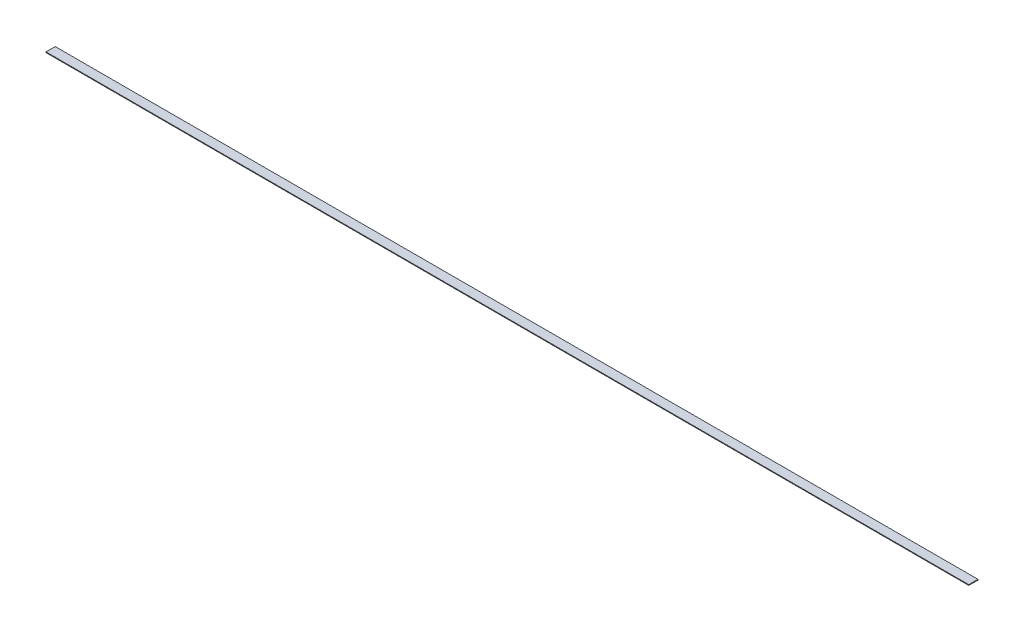
ISO-10303-21;
HEADER;
FILE_DESCRIPTION(('STEP AP214'),'2;1');
FILE_NAME('part.step','',(''),(''),'','','');
FILE_SCHEMA(('AUTOMOTIVE_DESIGN { 1 0 10303 214 1 1 1 1 }'));
ENDSEC;
DATA;
#1=APPLICATION_CONTEXT('core data for automotive mechanical design processes');
#2=APPLICATION_PROTOCOL_DEFINITION('international standard','automotive_design',2000,#1);
#3=PRODUCT_CONTEXT('',#1,'mechanical');
#4=PRODUCT('Part','Part','',(#3));
#5=PRODUCT_RELATED_PRODUCT_CATEGORY('part','',(#4));
#6=PRODUCT_DEFINITION_FORMATION('','',#4);
#7=PRODUCT_DEFINITION_CONTEXT('part definition',#1,'design');
#8=PRODUCT_DEFINITION('design','',#6,#7);
#9=PRODUCT_DEFINITION_SHAPE('','',#8);
#10=(LENGTH_UNIT() NAMED_UNIT(*) SI_UNIT(.MILLI.,.METRE.));
#11=(NAMED_UNIT(*) PLANE_ANGLE_UNIT() SI_UNIT($,.RADIAN.));
#12=(NAMED_UNIT(*) SI_UNIT($,.STERADIAN.) SOLID_ANGLE_UNIT());
#13=UNCERTAINTY_MEASURE_WITH_UNIT(LENGTH_MEASURE(1.E-05),#10,'distance_accuracy_value','');
#14=(GEOMETRIC_REPRESENTATION_CONTEXT(3) GLOBAL_UNCERTAINTY_ASSIGNED_CONTEXT((#13)) GLOBAL_UNIT_ASSIGNED_CONTEXT((#10,
#11,#12)) REPRESENTATION_CONTEXT('',''));
#15=CARTESIAN_POINT('',(0.,0.,0.));
#16=DIRECTION('',(0.,0.,1.));
#17=DIRECTION('',(1.,0.,0.));
#18=AXIS2_PLACEMENT_3D('',#15,#16,#17);
#19=CARTESIAN_POINT('',(2000.,-0.75,-10.));
#20=DIRECTION('',(0.,0.,1.));
#21=DIRECTION('',(1.,0.,0.));
#22=AXIS2_PLACEMENT_3D('',#19,#20,#21);
#23=PLANE('',#22);
#24=DIRECTION('',(0.,1.,0.));
#25=VECTOR('',#24,1.);
#26=CARTESIAN_POINT('',(0.,-0.75,-10.));
#27=LINE('',#26,#25);
#28=CARTESIAN_POINT('',(0.,-0.75,-10.));
#29=VERTEX_POINT('',#28);
#30=CARTESIAN_POINT('',(0.,0.75,-10.));
#31=VERTEX_POINT('',#30);
#32=EDGE_CURVE('E98',#29,#31,#27,.T.);
#33=ORIENTED_EDGE('',*,*,#32,.T.);
#34=DIRECTION('',(-1.,0.,0.));
#35=VECTOR('',#34,1.);
#36=CARTESIAN_POINT('',(2000.,0.75,-10.));
#37=LINE('',#36,#35);
#38=CARTESIAN_POINT('',(2000.,0.75,-10.));
#39=VERTEX_POINT('',#38);
#40=EDGE_CURVE('E11',#39,#31,#37,.T.);
#41=ORIENTED_EDGE('',*,*,#40,.F.);
#42=DIRECTION('',(0.,1.,0.));
#43=VECTOR('',#42,1.);
#44=CARTESIAN_POINT('',(2000.,-0.75,-10.));
#45=LINE('',#44,#43);
#46=CARTESIAN_POINT('',(2000.,-0.75,-10.));
#47=VERTEX_POINT('',#46);
#48=EDGE_CURVE('E86',#47,#39,#45,.T.);
#49=ORIENTED_EDGE('',*,*,#48,.F.);
#50=DIRECTION('',(-1.,0.,0.));
#51=VECTOR('',#50,1.);
#52=CARTESIAN_POINT('',(2000.,-0.75,-10.));
#53=LINE('',#52,#51);
#54=EDGE_CURVE('E94',#47,#29,#53,.T.);
#55=ORIENTED_EDGE('',*,*,#54,.T.);
#56=EDGE_LOOP('',(#33,#41,#49,#55));
#57=FACE_BOUND('',#56,.T.);
#58=ADVANCED_FACE('F35',(#57),#23,.F.);
#59=CARTESIAN_POINT('',(2000.,0.75,9.99999999999999));
#60=DIRECTION('',(0.,-1.,0.));
#61=DIRECTION('',(0.,0.,-1.));
#62=AXIS2_PLACEMENT_3D('',#59,#60,#61);
#63=PLANE('',#62);
#64=DIRECTION('',(0.,0.,1.));
#65=VECTOR('',#64,1.);
#66=CARTESIAN_POINT('',(0.,0.75,9.99999999999999));
#67=LINE('',#66,#65);
#68=CARTESIAN_POINT('',(0.,0.75,9.99999999999999));
#69=VERTEX_POINT('',#68);
#70=EDGE_CURVE('E90',#31,#69,#67,.T.);
#71=ORIENTED_EDGE('',*,*,#70,.T.);
#72=DIRECTION('',(-1.,0.,0.));
#73=VECTOR('',#72,1.);
#74=CARTESIAN_POINT('',(2000.,0.75,9.99999999999999));
#75=LINE('',#74,#73);
#76=CARTESIAN_POINT('',(2000.,0.75,9.99999999999999));
#77=VERTEX_POINT('',#76);
#78=EDGE_CURVE('E43',#77,#69,#75,.T.);
#79=ORIENTED_EDGE('',*,*,#78,.F.);
#80=DIRECTION('',(0.,0.,1.));
#81=VECTOR('',#80,1.);
#82=CARTESIAN_POINT('',(2000.,0.75,9.99999999999999));
#83=LINE('',#82,#81);
#84=EDGE_CURVE('E81',#39,#77,#83,.T.);
#85=ORIENTED_EDGE('',*,*,#84,.F.);
#86=ORIENTED_EDGE('',*,*,#40,.T.);
#87=EDGE_LOOP('',(#71,#79,#85,#86));
#88=FACE_BOUND('',#87,.T.);
#89=ADVANCED_FACE('F89',(#88),#63,.F.);
#90=CARTESIAN_POINT('',(2000.,-0.75,9.99999999999999));
#91=DIRECTION('',(0.,0.,-1.));
#92=DIRECTION('',(-1.,0.,0.));
#93=AXIS2_PLACEMENT_3D('',#90,#91,#92);
#94=PLANE('',#93);
#95=DIRECTION('',(0.,-1.,0.));
#96=VECTOR('',#95,1.);
#97=CARTESIAN_POINT('',(0.,-0.75,9.99999999999999));
#98=LINE('',#97,#96);
#99=CARTESIAN_POINT('',(0.,-0.75,9.99999999999999));
#100=VERTEX_POINT('',#99);
#101=EDGE_CURVE('E68',#69,#100,#98,.T.);
#102=ORIENTED_EDGE('',*,*,#101,.T.);
#103=DIRECTION('',(-1.,0.,0.));
#104=VECTOR('',#103,1.);
#105=CARTESIAN_POINT('',(2000.,-0.75,9.99999999999999));
#106=LINE('',#105,#104);
#107=CARTESIAN_POINT('',(2000.,-0.75,9.99999999999999));
#108=VERTEX_POINT('',#107);
#109=EDGE_CURVE('E91',#108,#100,#106,.T.);
#110=ORIENTED_EDGE('',*,*,#109,.F.);
#111=DIRECTION('',(0.,-1.,0.));
#112=VECTOR('',#111,1.);
#113=CARTESIAN_POINT('',(2000.,-0.75,9.99999999999999));
#114=LINE('',#113,#112);
#115=EDGE_CURVE('E84',#77,#108,#114,.T.);
#116=ORIENTED_EDGE('',*,*,#115,.F.);
#117=ORIENTED_EDGE('',*,*,#78,.T.);
#118=EDGE_LOOP('',(#102,#110,#116,#117));
#119=FACE_BOUND('',#118,.T.);
#120=ADVANCED_FACE('F92',(#119),#94,.F.);
#121=CARTESIAN_POINT('',(2000.,-0.75,9.99999999999999));
#122=DIRECTION('',(0.,1.,0.));
#123=DIRECTION('',(0.,0.,1.));
#124=AXIS2_PLACEMENT_3D('',#121,#122,#123);
#125=PLANE('',#124);
#126=DIRECTION('',(0.,0.,-1.));
#127=VECTOR('',#126,1.);
#128=CARTESIAN_POINT('',(0.,-0.75,9.99999999999999));
#129=LINE('',#128,#127);
#130=EDGE_CURVE('E74',#100,#29,#129,.T.);
#131=ORIENTED_EDGE('',*,*,#130,.T.);
#132=ORIENTED_EDGE('',*,*,#54,.F.);
#133=DIRECTION('',(0.,0.,-1.));
#134=VECTOR('',#133,1.);
#135=CARTESIAN_POINT('',(2000.,-0.75,9.99999999999999));
#136=LINE('',#135,#134);
#137=EDGE_CURVE('E51',#108,#47,#136,.T.);
#138=ORIENTED_EDGE('',*,*,#137,.F.);
#139=ORIENTED_EDGE('',*,*,#109,.T.);
#140=EDGE_LOOP('',(#131,#132,#138,#139));
#141=FACE_BOUND('',#140,.T.);
#142=ADVANCED_FACE('F105',(#141),#125,.F.);
#143=CARTESIAN_POINT('',(2000.,0.,0.));
#144=DIRECTION('',(-1.,0.,0.));
#145=DIRECTION('',(0.,0.,1.));
#146=AXIS2_PLACEMENT_3D('',#143,#144,#145);
#147=PLANE('',#146);
#148=ORIENTED_EDGE('',*,*,#48,.T.);
#149=ORIENTED_EDGE('',*,*,#84,.T.);
#150=ORIENTED_EDGE('',*,*,#115,.T.);
#151=ORIENTED_EDGE('',*,*,#137,.T.);
#152=EDGE_LOOP('',(#148,#149,#150,#151));
#153=FACE_BOUND('',#152,.T.);
#154=ADVANCED_FACE('F82',(#153),#147,.F.);
#155=CARTESIAN_POINT('',(0.,0.,0.));
#156=DIRECTION('',(-1.,0.,0.));
#157=DIRECTION('',(0.,0.,1.));
#158=AXIS2_PLACEMENT_3D('',#155,#156,#157);
#159=PLANE('',#158);
#160=ORIENTED_EDGE('',*,*,#32,.F.);
#161=ORIENTED_EDGE('',*,*,#130,.F.);
#162=ORIENTED_EDGE('',*,*,#101,.F.);
#163=ORIENTED_EDGE('',*,*,#70,.F.);
#164=EDGE_LOOP('',(#160,#161,#162,#163));
#165=FACE_BOUND('',#164,.T.);
#166=ADVANCED_FACE('F108',(#165),#159,.T.);
#167=CLOSED_SHELL('',(#58,#89,#120,#142,#154,#166));
#168=MANIFOLD_SOLID_BREP('B2',#167);
#169=ADVANCED_BREP_SHAPE_REPRESENTATION('',(#18,#168),#14);
#170=SHAPE_DEFINITION_REPRESENTATION(#9,#169);
ENDSEC;
END-ISO-10303-21;
